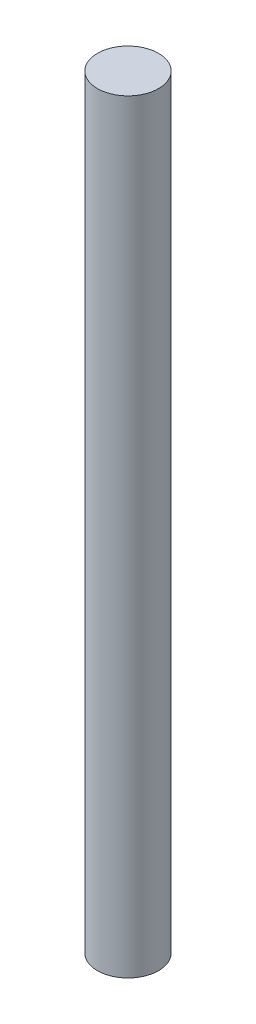
ISO-10303-21;
HEADER;
FILE_DESCRIPTION(('STEP AP214'),'2;1');
FILE_NAME('part.step','',(''),(''),'','','');
FILE_SCHEMA(('AUTOMOTIVE_DESIGN { 1 0 10303 214 1 1 1 1 }'));
ENDSEC;
DATA;
#1=APPLICATION_CONTEXT('core data for automotive mechanical design processes');
#2=APPLICATION_PROTOCOL_DEFINITION('international standard','automotive_design',2000,#1);
#3=PRODUCT_CONTEXT('',#1,'mechanical');
#4=PRODUCT('Part','Part','',(#3));
#5=PRODUCT_RELATED_PRODUCT_CATEGORY('part','',(#4));
#6=PRODUCT_DEFINITION_FORMATION('','',#4);
#7=PRODUCT_DEFINITION_CONTEXT('part definition',#1,'design');
#8=PRODUCT_DEFINITION('design','',#6,#7);
#9=PRODUCT_DEFINITION_SHAPE('','',#8);
#10=(LENGTH_UNIT() NAMED_UNIT(*) SI_UNIT(.MILLI.,.METRE.));
#11=(NAMED_UNIT(*) PLANE_ANGLE_UNIT() SI_UNIT($,.RADIAN.));
#12=(NAMED_UNIT(*) SI_UNIT($,.STERADIAN.) SOLID_ANGLE_UNIT());
#13=UNCERTAINTY_MEASURE_WITH_UNIT(LENGTH_MEASURE(1.E-05),#10,'distance_accuracy_value','');
#14=(GEOMETRIC_REPRESENTATION_CONTEXT(3) GLOBAL_UNCERTAINTY_ASSIGNED_CONTEXT((#13)) GLOBAL_UNIT_ASSIGNED_CONTEXT((#10,
#11,#12)) REPRESENTATION_CONTEXT('',''));
#15=CARTESIAN_POINT('',(0.,0.,0.));
#16=DIRECTION('',(0.,0.,1.));
#17=DIRECTION('',(1.,0.,0.));
#18=AXIS2_PLACEMENT_3D('',#15,#16,#17);
#19=CARTESIAN_POINT('',(-0.0277590215245657,12.7,0.));
#20=DIRECTION('',(0.,-1.,0.));
#21=DIRECTION('',(0.,0.,-1.));
#22=AXIS2_PLACEMENT_3D('',#19,#20,#21);
#23=CYLINDRICAL_SURFACE('',#22,0.508);
#24=CARTESIAN_POINT('',(-0.0277590215245657,12.7,0.));
#25=DIRECTION('',(0.,1.,0.));
#26=DIRECTION('',(0.,0.,1.));
#27=AXIS2_PLACEMENT_3D('',#24,#25,#26);
#28=CIRCLE('',#27,0.508);
#29=CARTESIAN_POINT('',(-0.0277590215245657,12.7,0.508));
#30=VERTEX_POINT('',#29);
#31=EDGE_CURVE('E10',#30,#30,#28,.T.);
#32=ORIENTED_EDGE('',*,*,#31,.F.);
#33=EDGE_LOOP('',(#32));
#34=FACE_BOUND('',#33,.T.);
#35=CARTESIAN_POINT('',(-0.0277590215245657,0.,0.));
#36=DIRECTION('',(0.,1.,0.));
#37=DIRECTION('',(0.,0.,1.));
#38=AXIS2_PLACEMENT_3D('',#35,#36,#37);
#39=CIRCLE('',#38,0.508);
#40=CARTESIAN_POINT('',(-0.0277590215245657,0.,0.508));
#41=VERTEX_POINT('',#40);
#42=EDGE_CURVE('E46',#41,#41,#39,.T.);
#43=ORIENTED_EDGE('',*,*,#42,.T.);
#44=EDGE_LOOP('',(#43));
#45=FACE_BOUND('',#44,.T.);
#46=ADVANCED_FACE('F43',(#34,#45),#23,.T.);
#47=CARTESIAN_POINT('',(-0.0277590215245657,12.7,0.));
#48=DIRECTION('',(0.,1.,0.));
#49=DIRECTION('',(0.,0.,1.));
#50=AXIS2_PLACEMENT_3D('',#47,#48,#49);
#51=PLANE('',#50);
#52=ORIENTED_EDGE('',*,*,#31,.T.);
#53=EDGE_LOOP('',(#52));
#54=FACE_BOUND('',#53,.T.);
#55=ADVANCED_FACE('F60',(#54),#51,.T.);
#56=CARTESIAN_POINT('',(-0.0277590215245657,0.,0.));
#57=DIRECTION('',(0.,1.,0.));
#58=DIRECTION('',(0.,0.,1.));
#59=AXIS2_PLACEMENT_3D('',#56,#57,#58);
#60=PLANE('',#59);
#61=ORIENTED_EDGE('',*,*,#42,.F.);
#62=EDGE_LOOP('',(#61));
#63=FACE_BOUND('',#62,.T.);
#64=ADVANCED_FACE('F58',(#63),#60,.F.);
#65=CLOSED_SHELL('',(#46,#55,#64));
#66=MANIFOLD_SOLID_BREP('B2',#65);
#67=ADVANCED_BREP_SHAPE_REPRESENTATION('',(#18,#66),#14);
#68=SHAPE_DEFINITION_REPRESENTATION(#9,#67);
ENDSEC;
END-ISO-10303-21;
